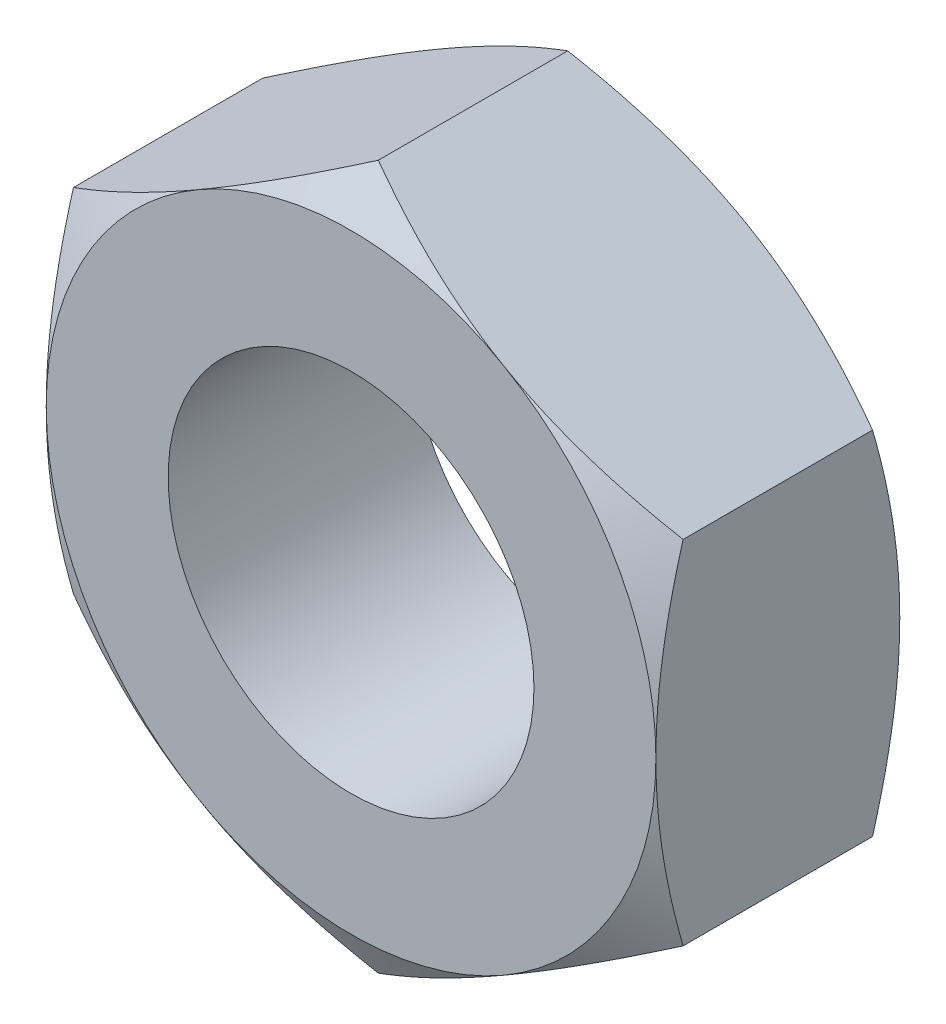
ISO-10303-21;
HEADER;
FILE_DESCRIPTION(('STEP AP214'),'2;1');
FILE_NAME('part.step','',(''),(''),'','','');
FILE_SCHEMA(('AUTOMOTIVE_DESIGN { 1 0 10303 214 1 1 1 1 }'));
ENDSEC;
DATA;
#1=APPLICATION_CONTEXT('core data for automotive mechanical design processes');
#2=APPLICATION_PROTOCOL_DEFINITION('international standard','automotive_design',2000,#1);
#3=PRODUCT_CONTEXT('',#1,'mechanical');
#4=PRODUCT('Part','Part','',(#3));
#5=PRODUCT_RELATED_PRODUCT_CATEGORY('part','',(#4));
#6=PRODUCT_DEFINITION_FORMATION('','',#4);
#7=PRODUCT_DEFINITION_CONTEXT('part definition',#1,'design');
#8=PRODUCT_DEFINITION('design','',#6,#7);
#9=PRODUCT_DEFINITION_SHAPE('','',#8);
#10=(LENGTH_UNIT() NAMED_UNIT(*) SI_UNIT(.MILLI.,.METRE.));
#11=(NAMED_UNIT(*) PLANE_ANGLE_UNIT() SI_UNIT($,.RADIAN.));
#12=(NAMED_UNIT(*) SI_UNIT($,.STERADIAN.) SOLID_ANGLE_UNIT());
#13=UNCERTAINTY_MEASURE_WITH_UNIT(LENGTH_MEASURE(1.E-05),#10,'distance_accuracy_value','');
#14=(GEOMETRIC_REPRESENTATION_CONTEXT(3) GLOBAL_UNCERTAINTY_ASSIGNED_CONTEXT((#13)) GLOBAL_UNIT_ASSIGNED_CONTEXT((#10,
#11,#12)) REPRESENTATION_CONTEXT('',''));
#15=CARTESIAN_POINT('',(0.,0.,0.));
#16=DIRECTION('',(0.,0.,1.));
#17=DIRECTION('',(1.,0.,0.));
#18=AXIS2_PLACEMENT_3D('',#15,#16,#17);
#19=CARTESIAN_POINT('',(-2.49999999999997,-1.44337567297409,2.));
#20=DIRECTION('',(0.499999999999995,0.866025403784441,0.));
#21=DIRECTION('',(-0.866025403784442,0.499999999999995,0.));
#22=AXIS2_PLACEMENT_3D('',#19,#20,#21);
#23=PLANE('',#22);
#24=CARTESIAN_POINT('',(0.000200000000000162,-2.88686681600195,0.2233576643591));
#25=CARTESIAN_POINT('',(-0.109663234734871,-2.82343724785373,0.186721620107618));
#26=CARTESIAN_POINT('',(-0.220474799896525,-2.75946016087833,0.153402218965049));
#27=CARTESIAN_POINT('',(-0.444016833466049,-2.63039810762177,0.0952422855578519));
#28=CARTESIAN_POINT('',(-0.556751274528388,-2.56531084772749,0.0704223291477331));
#29=CARTESIAN_POINT('',(-0.780822993875268,-2.43594298024479,0.0317856514410478));
#30=CARTESIAN_POINT('',(-0.892125791767376,-2.37168227992022,0.0177117961856351));
#31=CARTESIAN_POINT('',(-1.11525522746833,-2.24285844015414,0.000909152352747347));
#32=CARTESIAN_POINT('',(-1.22708105401423,-2.17829576909552,-0.00183354879637574));
#33=CARTESIAN_POINT('',(-1.43604197555152,-2.05765212479586,0.00386576000805192));
#34=CARTESIAN_POINT('',(-1.53320831755773,-2.0015531110824,0.0109083943818601));
#35=CARTESIAN_POINT('',(-1.72690794971099,-1.88972057631678,0.0332314191249406));
#36=CARTESIAN_POINT('',(-1.82344056965972,-1.83398744220381,0.0485194384402649));
#37=CARTESIAN_POINT('',(-2.01753972174046,-1.72192424450051,0.086739093844417));
#38=CARTESIAN_POINT('',(-2.11508168178212,-1.66560836761318,0.109832776125513));
#39=CARTESIAN_POINT('',(-2.30871060807606,-1.55381665489447,0.162246656577907));
#40=CARTESIAN_POINT('',(-2.40480005588615,-1.49833938633504,0.191554535624541));
#41=CARTESIAN_POINT('',(-2.50019999999997,-1.44326020292025,0.2233576643591));
#42=B_SPLINE_CURVE_WITH_KNOTS('',3,(#24,#25,#26,#27,#28,#29,#30,#31,#32,#33,#34,#35,#36,#37,#38,
#39,#40,#41),.UNSPECIFIED.,.F.,.F.,(4,2,2,2,2,2,2,2,4),(0.,0.396285827362224,0.793524330152047,
1.18093086852113,1.56786160134475,1.90479741793731,2.2420455166046,2.58677531536753,
2.93082800105252),.UNSPECIFIED.);
#43=CARTESIAN_POINT('',(0.,-2.88675134594811,0.223290993692593));
#44=VERTEX_POINT('',#43);
#45=CARTESIAN_POINT('',(-1.24999999999999,-2.1650635094611,0.));
#46=VERTEX_POINT('',#45);
#47=EDGE_CURVE('E266',#44,#46,#42,.T.);
#48=ORIENTED_EDGE('',*,*,#47,.F.);
#49=DIRECTION('',(0.,0.,-1.));
#50=VECTOR('',#49,1.);
#51=CARTESIAN_POINT('',(0.,-2.88675134594811,2.));
#52=LINE('',#51,#50);
#53=CARTESIAN_POINT('',(0.,-2.88675134594811,1.77670900630741));
#54=VERTEX_POINT('',#53);
#55=EDGE_CURVE('E309',#54,#44,#52,.T.);
#56=ORIENTED_EDGE('',*,*,#55,.F.);
#57=CARTESIAN_POINT('',(-2.50019999999997,-1.44326020292025,1.7766423356409));
#58=CARTESIAN_POINT('',(-2.3903367652651,-1.50668977106847,1.81327837989238));
#59=CARTESIAN_POINT('',(-2.27952520010345,-1.57066685804387,1.84659778103495));
#60=CARTESIAN_POINT('',(-2.05598316653392,-1.69972891130043,1.90475771444215));
#61=CARTESIAN_POINT('',(-1.94324872547158,-1.76481617119471,1.92957767085227));
#62=CARTESIAN_POINT('',(-1.7191770061247,-1.89418403867742,1.96821434855895));
#63=CARTESIAN_POINT('',(-1.60787420823259,-1.95844473900198,1.98228820381436));
#64=CARTESIAN_POINT('',(-1.38474477253164,-2.08726857876806,1.99909084764725));
#65=CARTESIAN_POINT('',(-1.27291894598575,-2.15183124982668,2.00183354879638));
#66=CARTESIAN_POINT('',(-1.06395802444845,-2.27247489412635,1.99613423999195));
#67=CARTESIAN_POINT('',(-0.966791682442246,-2.3285739078398,1.98909160561814));
#68=CARTESIAN_POINT('',(-0.773092050288979,-2.44040644260542,1.96676858087506));
#69=CARTESIAN_POINT('',(-0.676559430340252,-2.4961395767184,1.95148056155974));
#70=CARTESIAN_POINT('',(-0.482460278259513,-2.60820277442169,1.91326090615558));
#71=CARTESIAN_POINT('',(-0.38491831821785,-2.66451865130902,1.89016722387449));
#72=CARTESIAN_POINT('',(-0.19128939192391,-2.77631036402773,1.83775334342209));
#73=CARTESIAN_POINT('',(-0.0951999441138213,-2.83178763258716,1.80844546437546));
#74=CARTESIAN_POINT('',(0.000200000000000241,-2.88686681600195,1.7766423356409));
#75=B_SPLINE_CURVE_WITH_KNOTS('',3,(#57,#58,#59,#60,#61,#62,#63,#64,#65,#66,#67,#68,#69,#70,#71,
#72,#73,#74),.UNSPECIFIED.,.F.,.F.,(4,2,2,2,2,2,2,2,4),(0.,0.396285827362225,0.793524330152047,
1.18093086852113,1.56786160134475,1.90479741793731,2.2420455166046,2.58677531536753,
2.93082800105252),.UNSPECIFIED.);
#76=CARTESIAN_POINT('',(-1.24999999999999,-2.1650635094611,2.));
#77=VERTEX_POINT('',#76);
#78=EDGE_CURVE('E216',#77,#54,#75,.T.);
#79=ORIENTED_EDGE('',*,*,#78,.F.);
#80=CARTESIAN_POINT('',(-2.49999999999997,-1.44337567297421,1.77670900630749));
#81=VERTEX_POINT('',#80);
#82=EDGE_CURVE('E292',#81,#77,#75,.T.);
#83=ORIENTED_EDGE('',*,*,#82,.F.);
#84=DIRECTION('',(0.,0.,-1.));
#85=VECTOR('',#84,1.);
#86=CARTESIAN_POINT('',(-2.49999999999997,-1.44337567297409,2.));
#87=LINE('',#86,#85);
#88=CARTESIAN_POINT('',(-2.49999999999997,-1.44337567297421,0.223290993692512));
#89=VERTEX_POINT('',#88);
#90=EDGE_CURVE('E289',#81,#89,#87,.T.);
#91=ORIENTED_EDGE('',*,*,#90,.T.);
#92=EDGE_CURVE('E253',#46,#89,#42,.T.);
#93=ORIENTED_EDGE('',*,*,#92,.F.);
#94=EDGE_LOOP('',(#48,#56,#79,#83,#91,#93));
#95=FACE_BOUND('',#94,.T.);
#96=ADVANCED_FACE('F36',(#95),#23,.F.);
#97=CARTESIAN_POINT('',(0.,-2.88675134594811,2.));
#98=DIRECTION('',(-0.500000000000001,0.866025403784438,0.));
#99=DIRECTION('',(-0.866025403784438,-0.500000000000001,0.));
#100=AXIS2_PLACEMENT_3D('',#97,#98,#99);
#101=PLANE('',#100);
#102=CARTESIAN_POINT('',(2.50019999999999,-1.44326020292021,0.2233576643591));
#103=CARTESIAN_POINT('',(2.39033676526512,-1.50668977106843,0.186721620107618));
#104=CARTESIAN_POINT('',(2.27952520010347,-1.57066685804384,0.153402218965048));
#105=CARTESIAN_POINT('',(2.05598316653394,-1.6997289113004,0.0952422855578497));
#106=CARTESIAN_POINT('',(1.94324872547161,-1.76481617119468,0.0704223291477302));
#107=CARTESIAN_POINT('',(1.71917700612473,-1.89418403867739,0.0317856514410439));
#108=CARTESIAN_POINT('',(1.60787420823262,-1.95844473900195,0.0177117961856309));
#109=CARTESIAN_POINT('',(1.38474477253166,-2.08726857876803,0.000909152352742216));
#110=CARTESIAN_POINT('',(1.27291894598577,-2.15183124982665,-0.00183354879638143));
#111=CARTESIAN_POINT('',(1.06395802444848,-2.27247489412632,0.00386576000804523));
#112=CARTESIAN_POINT('',(0.966791682442268,-2.32857390783978,0.0109083943818532));
#113=CARTESIAN_POINT('',(0.773092050288997,-2.4404064426054,0.033231419124934));
#114=CARTESIAN_POINT('',(0.676559430340268,-2.49613957671838,0.0485194384402587));
#115=CARTESIAN_POINT('',(0.482460278259524,-2.60820277442168,0.0867390938444119));
#116=CARTESIAN_POINT('',(0.384918318217859,-2.66451865130902,0.109832776125509));
#117=CARTESIAN_POINT('',(0.191289391923915,-2.77631036402772,0.162246656577905));
#118=CARTESIAN_POINT('',(0.0951999441138241,-2.83178763258716,0.19155453562454));
#119=CARTESIAN_POINT('',(-0.000199999999999883,-2.88686681600195,0.2233576643591));
#120=B_SPLINE_CURVE_WITH_KNOTS('',3,(#102,#103,#104,#105,#106,#107,#108,#109,#110,#111,#112,
#113,#114,#115,#116,#117,#118,#119),.UNSPECIFIED.,.F.,.F.,(4,2,2,2,2,2,2,2,4),(0.,
0.396285827362225,0.793524330152047,1.18093086852113,1.56786160134475,1.90479741793732,
2.24204551660462,2.58677531536755,2.93082800105256),.UNSPECIFIED.);
#121=CARTESIAN_POINT('',(2.49999999999999,-1.44337567297405,0.223290993692593));
#122=VERTEX_POINT('',#121);
#123=CARTESIAN_POINT('',(1.25,-2.1650635094611,0.));
#124=VERTEX_POINT('',#123);
#125=EDGE_CURVE('E144',#122,#124,#120,.T.);
#126=ORIENTED_EDGE('',*,*,#125,.F.);
#127=DIRECTION('',(0.,0.,-1.));
#128=VECTOR('',#127,1.);
#129=CARTESIAN_POINT('',(2.49999999999999,-1.44337567297405,2.));
#130=LINE('',#129,#128);
#131=CARTESIAN_POINT('',(2.49999999999999,-1.44337567297417,1.77670900630749));
#132=VERTEX_POINT('',#131);
#133=EDGE_CURVE('E156',#132,#122,#130,.T.);
#134=ORIENTED_EDGE('',*,*,#133,.F.);
#135=CARTESIAN_POINT('',(-0.000200000000000074,-2.88686681600195,1.7766423356409));
#136=CARTESIAN_POINT('',(0.10966323473487,-2.82343724785373,1.81327837989238));
#137=CARTESIAN_POINT('',(0.220474799896524,-2.75946016087833,1.84659778103495));
#138=CARTESIAN_POINT('',(0.444016833466047,-2.63039810762177,1.90475771444215));
#139=CARTESIAN_POINT('',(0.556751274528385,-2.56531084772748,1.92957767085227));
#140=CARTESIAN_POINT('',(0.780822993875264,-2.43594298024478,1.96821434855896));
#141=CARTESIAN_POINT('',(0.892125791767372,-2.37168227992021,1.98228820381437));
#142=CARTESIAN_POINT('',(1.11525522746833,-2.24285844015414,1.99909084764726));
#143=CARTESIAN_POINT('',(1.22708105401422,-2.17829576909551,2.00183354879638));
#144=CARTESIAN_POINT('',(1.43604197555151,-2.05765212479585,1.99613423999195));
#145=CARTESIAN_POINT('',(1.53320831755772,-2.00155311108239,1.98909160561815));
#146=CARTESIAN_POINT('',(1.72690794971099,-1.88972057631677,1.96676858087507));
#147=CARTESIAN_POINT('',(1.82344056965972,-1.83398744220379,1.95148056155974));
#148=CARTESIAN_POINT('',(2.01753972174047,-1.72192424450049,1.91326090615559));
#149=CARTESIAN_POINT('',(2.11508168178213,-1.66560836761315,1.89016722387449));
#150=CARTESIAN_POINT('',(2.30871060807608,-1.55381665489444,1.8377533434221));
#151=CARTESIAN_POINT('',(2.40480005588617,-1.49833938633501,1.80844546437546));
#152=CARTESIAN_POINT('',(2.50019999999999,-1.44326020292021,1.7766423356409));
#153=B_SPLINE_CURVE_WITH_KNOTS('',3,(#135,#136,#137,#138,#139,#140,#141,#142,#143,#144,#145,
#146,#147,#148,#149,#150,#151,#152),.UNSPECIFIED.,.F.,.F.,(4,2,2,2,2,2,2,2,4),(0.,
0.396285827362224,0.793524330152047,1.18093086852113,1.56786160134475,1.90479741793732,
2.24204551660462,2.58677531536755,2.93082800105256),.UNSPECIFIED.);
#154=CARTESIAN_POINT('',(1.25,-2.16506350946108,2.));
#155=VERTEX_POINT('',#154);
#156=EDGE_CURVE('E199',#155,#132,#153,.T.);
#157=ORIENTED_EDGE('',*,*,#156,.F.);
#158=EDGE_CURVE('E333',#54,#155,#153,.T.);
#159=ORIENTED_EDGE('',*,*,#158,.F.);
#160=ORIENTED_EDGE('',*,*,#55,.T.);
#161=EDGE_CURVE('E166',#124,#44,#120,.T.);
#162=ORIENTED_EDGE('',*,*,#161,.F.);
#163=EDGE_LOOP('',(#126,#134,#157,#159,#160,#162));
#164=FACE_BOUND('',#163,.T.);
#165=ADVANCED_FACE('F179',(#164),#101,.F.);
#166=CARTESIAN_POINT('',(2.49999999999999,-1.44337567297405,2.));
#167=DIRECTION('',(-1.,0.,0.));
#168=DIRECTION('',(0.,-1.,0.));
#169=AXIS2_PLACEMENT_3D('',#166,#167,#168);
#170=PLANE('',#169);
#171=CARTESIAN_POINT('',(2.5,-3.93425573570174,1.24786742231988));
#172=CARTESIAN_POINT('',(2.5,-3.82455805271518,1.19442683286789));
#173=CARTESIAN_POINT('',(2.5,-3.71461458124995,1.1414824250811));
#174=CARTESIAN_POINT('',(2.5,-3.49410553801961,1.03686398179162));
#175=CARTESIAN_POINT('',(2.5,-3.38353987636771,0.985190135952728));
#176=CARTESIAN_POINT('',(2.5,-3.1611133721341,0.883143029913734));
#177=CARTESIAN_POINT('',(2.5,-3.04924878665415,0.832777900698826));
#178=CARTESIAN_POINT('',(2.5,-2.8246495074574,0.734034164431113));
#179=CARTESIAN_POINT('',(2.5,-2.71191485354297,0.685655467138938));
#180=CARTESIAN_POINT('',(2.49999999999999,-2.4815726289783,0.589816347587659));
#181=CARTESIAN_POINT('',(2.49999999999999,-2.36392903093314,0.542442056681136));
#182=CARTESIAN_POINT('',(2.49999999999999,-2.12728680673992,0.451142480581939));
#183=CARTESIAN_POINT('',(2.49999999999999,-2.00828803339158,0.407217574235718));
#184=CARTESIAN_POINT('',(2.49999999999999,-1.76895086303134,0.323927966543298));
#185=CARTESIAN_POINT('',(2.49999999999999,-1.64861554144244,0.284554513885219));
#186=CARTESIAN_POINT('',(2.49999999999999,-1.40621964850133,0.21159319438697));
#187=CARTESIAN_POINT('',(2.49999999999999,-1.28415961496497,0.178003565258964));
#188=CARTESIAN_POINT('',(2.49999999999999,-1.0389195188697,0.118361804718263));
#189=CARTESIAN_POINT('',(2.49999999999999,-0.915749874741587,0.0922676059427502));
#190=CARTESIAN_POINT('',(2.49999999999999,-0.667820858109997,0.0490550373819117));
#191=CARTESIAN_POINT('',(2.49999999999999,-0.543061659325973,0.0319356952253109));
#192=CARTESIAN_POINT('',(2.49999999999999,-0.294229286789481,0.00825976303698975));
#193=CARTESIAN_POINT('',(2.49999999999999,-0.170169796196182,0.0015629187993084));
#194=CARTESIAN_POINT('',(2.49999999999999,0.0780766731615942,-0.00107330125971436));
#195=CARTESIAN_POINT('',(2.49999999999999,0.202263653840971,0.00298748693341116));
#196=CARTESIAN_POINT('',(2.49999999999998,0.411409604725348,0.0185927331632678));
#197=CARTESIAN_POINT('',(2.49999999999998,0.496584671497748,0.0274243081141329));
#198=CARTESIAN_POINT('',(2.49999999999998,0.666344730959548,0.0496284777980075));
#199=CARTESIAN_POINT('',(2.49999999999998,0.750929648415659,0.063001641083345));
#200=CARTESIAN_POINT('',(2.49999999999998,1.00366548007522,0.109234028667318));
#201=CARTESIAN_POINT('',(2.49999999999998,1.17071375552299,0.148199044449048));
#202=CARTESIAN_POINT('',(2.49999999999998,1.4206286514283,0.216203518781425));
#203=CARTESIAN_POINT('',(2.49999999999998,1.50477790209398,0.240801494595756));
#204=CARTESIAN_POINT('',(2.49999999999998,1.67225987920894,0.292660070165323));
#205=CARTESIAN_POINT('',(2.49999999999998,1.75559259937951,0.319920690377339));
#206=CARTESIAN_POINT('',(2.49999999999998,1.92146681890304,0.376658162164918));
#207=CARTESIAN_POINT('',(2.49999999999998,2.00400853495824,0.406134385980853));
#208=CARTESIAN_POINT('',(2.49999999999998,2.16840002368736,0.466945522238705));
#209=CARTESIAN_POINT('',(2.49999999999998,2.25024981200959,0.498280392517164));
#210=CARTESIAN_POINT('',(2.49999999999998,2.47007598379912,0.584843598085943));
#211=CARTESIAN_POINT('',(2.49999999999998,2.60747896260624,0.641526709598319));
#212=CARTESIAN_POINT('',(2.49999999999998,2.88087320813983,0.758212721815775));
#213=CARTESIAN_POINT('',(2.49999999999998,3.01686431759797,0.818215987739867));
#214=CARTESIAN_POINT('',(2.49999999999997,3.28775371033888,0.940755016909798));
#215=CARTESIAN_POINT('',(2.49999999999997,3.42265159883759,1.00329165002619));
#216=CARTESIAN_POINT('',(2.49999999999997,3.69153349617871,1.13030325926438));
#217=CARTESIAN_POINT('',(2.49999999999997,3.82551747693042,1.19477829464024));
#218=CARTESIAN_POINT('',(2.49999999999997,4.22678780318403,1.39065285591914));
#219=CARTESIAN_POINT('',(2.49999999999997,4.49297167508688,1.52430796749618));
#220=CARTESIAN_POINT('',(2.49999999999997,5.02332787108775,1.79538779124832));
#221=CARTESIAN_POINT('',(2.49999999999997,5.28750060208648,1.93281171353398));
#222=CARTESIAN_POINT('',(2.49999999999997,5.78669441053013,2.19560284746361));
#223=CARTESIAN_POINT('',(2.49999999999997,6.02185115865901,2.32071278514315));
#224=CARTESIAN_POINT('',(2.49999999999996,6.49137306636739,2.57244119196158));
#225=CARTESIAN_POINT('',(2.49999999999996,6.7257381764787,2.69905975321281));
#226=CARTESIAN_POINT('',(2.49999999999996,7.19307672107728,2.95299069470952));
#227=CARTESIAN_POINT('',(2.49999999999996,7.42605218847075,3.08029933799));
#228=CARTESIAN_POINT('',(2.49999999999996,7.89150863123006,3.33577450416362));
#229=CARTESIAN_POINT('',(2.49999999999996,8.12398964405185,3.46394095878685));
#230=CARTESIAN_POINT('',(2.49999999999996,8.35629687842252,3.59241944863064));
#231=B_SPLINE_CURVE_WITH_KNOTS('',3,(#171,#172,#173,#174,#175,#176,#177,#178,#179,#180,#181,
#182,#183,#184,#185,#186,#187,#188,#189,#190,#191,#192,#193,#194,#195,#196,#197,#198,#199,#200,
#201,#202,#203,#204,#205,#206,#207,#208,#209,#210,#211,#212,#213,#214,#215,#216,#217,#218,#219,
#220,#221,#222,#223,#224,#225,#226,#227,#228,#229,#230),.UNSPECIFIED.,.F.,.F.,(4,2,2,2,2,2,2,2,
2,2,2,2,2,2,2,2,2,2,2,2,2,2,2,2,2,2,2,2,2,4),(0.,0.366071555956611,0.732197429693603,
1.10022131466406,1.46822846255462,1.84865877257403,2.22913080704688,2.60885867248576,
2.98847063215674,3.36590845840163,3.74330538309199,4.11557841167118,4.4878571160823,
4.74462879425845,5.00143262902233,5.51529120295764,5.7782794978535,6.04126981341614,
6.30418589329148,6.56709601118611,7.01293774320754,7.45882861596655,7.9048739119297,
8.35093285672014,9.24444046413292,10.1377622149405,10.9368546431961,11.7359961144143,
12.5324647674532,13.3288707690047),.UNSPECIFIED.);
#232=CARTESIAN_POINT('',(2.49999999999998,1.44337567297407,0.223290993692593));
#233=VERTEX_POINT('',#232);
#234=CARTESIAN_POINT('',(2.5,0.,0.));
#235=VERTEX_POINT('',#234);
#236=EDGE_CURVE('E125',#233,#235,#231,.F.);
#237=ORIENTED_EDGE('',*,*,#236,.F.);
#238=DIRECTION('',(0.,0.,-1.));
#239=VECTOR('',#238,1.);
#240=CARTESIAN_POINT('',(2.49999999999998,1.44337567297407,2.));
#241=LINE('',#240,#239);
#242=CARTESIAN_POINT('',(2.49999999999998,1.44337567297407,1.77670900630741));
#243=VERTEX_POINT('',#242);
#244=EDGE_CURVE('E307',#243,#233,#241,.T.);
#245=ORIENTED_EDGE('',*,*,#244,.F.);
#246=CARTESIAN_POINT('',(2.5,-3.93425573570174,0.752132577680122));
#247=CARTESIAN_POINT('',(2.5,-3.82455805271518,0.805573167132106));
#248=CARTESIAN_POINT('',(2.5,-3.71461458124995,0.858517574918903));
#249=CARTESIAN_POINT('',(2.5,-3.49410553801961,0.96313601820838));
#250=CARTESIAN_POINT('',(2.5,-3.3835398763677,1.01480986404727));
#251=CARTESIAN_POINT('',(2.5,-3.1611133721341,1.11685697008627));
#252=CARTESIAN_POINT('',(2.5,-3.04924878665415,1.16722209930117));
#253=CARTESIAN_POINT('',(2.5,-2.8246495074574,1.26596583556889));
#254=CARTESIAN_POINT('',(2.5,-2.71191485354297,1.31434453286106));
#255=CARTESIAN_POINT('',(2.49999999999999,-2.4815726289783,1.41018365241234));
#256=CARTESIAN_POINT('',(2.49999999999999,-2.36392903093314,1.45755794331886));
#257=CARTESIAN_POINT('',(2.49999999999999,-2.12728680673992,1.54885751941806));
#258=CARTESIAN_POINT('',(2.49999999999999,-2.00828803339158,1.59278242576428));
#259=CARTESIAN_POINT('',(2.49999999999999,-1.76895086303134,1.6760720334567));
#260=CARTESIAN_POINT('',(2.49999999999999,-1.64861554144244,1.71544548611478));
#261=CARTESIAN_POINT('',(2.49999999999999,-1.40621964850133,1.78840680561303));
#262=CARTESIAN_POINT('',(2.49999999999999,-1.28415961496497,1.82199643474104));
#263=CARTESIAN_POINT('',(2.49999999999999,-1.0389195188697,1.88163819528174));
#264=CARTESIAN_POINT('',(2.49999999999999,-0.915749874741587,1.90773239405725));
#265=CARTESIAN_POINT('',(2.49999999999999,-0.667820858109997,1.95094496261809));
#266=CARTESIAN_POINT('',(2.49999999999999,-0.543061659325972,1.96806430477469));
#267=CARTESIAN_POINT('',(2.49999999999999,-0.294229286789481,1.99174023696301));
#268=CARTESIAN_POINT('',(2.49999999999999,-0.170169796196181,1.99843708120069));
#269=CARTESIAN_POINT('',(2.49999999999999,0.0780766731615949,2.00107330125971));
#270=CARTESIAN_POINT('',(2.49999999999999,0.202263653840971,1.99701251306659));
#271=CARTESIAN_POINT('',(2.49999999999998,0.411409604725348,1.98140726683673));
#272=CARTESIAN_POINT('',(2.49999999999998,0.496584671497748,1.97257569188587));
#273=CARTESIAN_POINT('',(2.49999999999998,0.666344730959547,1.95037152220199));
#274=CARTESIAN_POINT('',(2.49999999999998,0.750929648415658,1.93699835891666));
#275=CARTESIAN_POINT('',(2.49999999999998,1.00366548007522,1.89076597133268));
#276=CARTESIAN_POINT('',(2.49999999999998,1.17071375552299,1.85180095555095));
#277=CARTESIAN_POINT('',(2.49999999999998,1.4206286514283,1.78379648121857));
#278=CARTESIAN_POINT('',(2.49999999999998,1.50477790209398,1.75919850540424));
#279=CARTESIAN_POINT('',(2.49999999999998,1.67225987920894,1.70733992983468));
#280=CARTESIAN_POINT('',(2.49999999999998,1.75559259937951,1.68007930962266));
#281=CARTESIAN_POINT('',(2.49999999999998,1.92146681890304,1.62334183783508));
#282=CARTESIAN_POINT('',(2.49999999999998,2.00400853495824,1.59386561401915));
#283=CARTESIAN_POINT('',(2.49999999999998,2.16840002368736,1.53305447776129));
#284=CARTESIAN_POINT('',(2.49999999999998,2.25024981200959,1.50171960748284));
#285=CARTESIAN_POINT('',(2.49999999999998,2.47007598379913,1.41515640191406));
#286=CARTESIAN_POINT('',(2.49999999999998,2.60747896260624,1.35847329040168));
#287=CARTESIAN_POINT('',(2.49999999999998,2.88087320813983,1.24178727818422));
#288=CARTESIAN_POINT('',(2.49999999999998,3.01686431759797,1.18178401226013));
#289=CARTESIAN_POINT('',(2.49999999999997,3.28775371033888,1.0592449830902));
#290=CARTESIAN_POINT('',(2.49999999999997,3.42265159883759,0.996708349973814));
#291=CARTESIAN_POINT('',(2.49999999999997,3.69153349617871,0.86969674073562));
#292=CARTESIAN_POINT('',(2.49999999999997,3.82551747693042,0.805221705359762));
#293=CARTESIAN_POINT('',(2.49999999999997,4.22678780318403,0.609347144080856));
#294=CARTESIAN_POINT('',(2.49999999999997,4.49297167508688,0.475692032503817));
#295=CARTESIAN_POINT('',(2.49999999999997,5.02332787108775,0.204612208751678));
#296=CARTESIAN_POINT('',(2.49999999999997,5.28750060208648,0.0671882864660215));
#297=CARTESIAN_POINT('',(2.49999999999997,5.78669441053013,-0.195602847463607));
#298=CARTESIAN_POINT('',(2.49999999999997,6.02185115865901,-0.320712785143147));
#299=CARTESIAN_POINT('',(2.49999999999996,6.49137306636739,-0.572441191961576));
#300=CARTESIAN_POINT('',(2.49999999999996,6.7257381764787,-0.699059753212815));
#301=CARTESIAN_POINT('',(2.49999999999996,7.19307672107728,-0.952990694709516));
#302=CARTESIAN_POINT('',(2.49999999999996,7.42605218847075,-1.08029933799));
#303=CARTESIAN_POINT('',(2.49999999999996,7.89150863123006,-1.33577450416362));
#304=CARTESIAN_POINT('',(2.49999999999996,8.12398964405185,-1.46394095878685));
#305=CARTESIAN_POINT('',(2.49999999999996,8.35629687842252,-1.59241944863064));
#306=B_SPLINE_CURVE_WITH_KNOTS('',3,(#246,#247,#248,#249,#250,#251,#252,#253,#254,#255,#256,
#257,#258,#259,#260,#261,#262,#263,#264,#265,#266,#267,#268,#269,#270,#271,#272,#273,#274,#275,
#276,#277,#278,#279,#280,#281,#282,#283,#284,#285,#286,#287,#288,#289,#290,#291,#292,#293,#294,
#295,#296,#297,#298,#299,#300,#301,#302,#303,#304,#305),.UNSPECIFIED.,.F.,.F.,(4,2,2,2,2,2,2,2,
2,2,2,2,2,2,2,2,2,2,2,2,2,2,2,2,2,2,2,2,2,4),(0.,0.366071555956611,0.732197429693603,
1.10022131466407,1.46822846255462,1.84865877257403,2.22913080704688,2.60885867248576,
2.98847063215674,3.36590845840163,3.74330538309199,4.11557841167118,4.4878571160823,
4.74462879425845,5.00143262902233,5.51529120295764,5.7782794978535,6.04126981341614,
6.30418589329148,6.56709601118611,7.01293774320754,7.45882861596655,7.9048739119297,
8.35093285672014,9.24444046413292,10.1377622149405,10.9368546431961,11.7359961144143,
12.5324647674532,13.3288707690047),.UNSPECIFIED.);
#307=CARTESIAN_POINT('',(2.49999999999999,0.,2.));
#308=VERTEX_POINT('',#307);
#309=EDGE_CURVE('E185',#308,#243,#306,.T.);
#310=ORIENTED_EDGE('',*,*,#309,.F.);
#311=EDGE_CURVE('E192',#132,#308,#306,.T.);
#312=ORIENTED_EDGE('',*,*,#311,.F.);
#313=ORIENTED_EDGE('',*,*,#133,.T.);
#314=EDGE_CURVE('E137',#235,#122,#231,.F.);
#315=ORIENTED_EDGE('',*,*,#314,.F.);
#316=EDGE_LOOP('',(#237,#245,#310,#312,#313,#315));
#317=FACE_BOUND('',#316,.T.);
#318=ADVANCED_FACE('F153',(#317),#170,.F.);
#319=CARTESIAN_POINT('',(2.49999999999998,1.44337567297407,2.));
#320=DIRECTION('',(-0.499999999999995,-0.866025403784442,0.));
#321=DIRECTION('',(0.866025403784442,-0.499999999999995,0.));
#322=AXIS2_PLACEMENT_3D('',#319,#320,#321);
#323=PLANE('',#322);
#324=CARTESIAN_POINT('',(-0.000200000000020158,2.88686681600195,0.2233576643591));
#325=CARTESIAN_POINT('',(0.109663234734851,2.82343724785373,0.186721620107617));
#326=CARTESIAN_POINT('',(0.220474799896505,2.75946016087833,0.153402218965048));
#327=CARTESIAN_POINT('',(0.444016833466029,2.63039810762177,0.0952422855578498));
#328=CARTESIAN_POINT('',(0.556751274528367,2.56531084772749,0.0704223291477303));
#329=CARTESIAN_POINT('',(0.780822993875247,2.43594298024479,0.0317856514410441));
#330=CARTESIAN_POINT('',(0.892125791767355,2.37168227992022,0.017711796185631));
#331=CARTESIAN_POINT('',(1.11525522746831,2.24285844015414,0.000909152352742206));
#332=CARTESIAN_POINT('',(1.2270810540142,2.17829576909552,-0.00183354879638151));
#333=CARTESIAN_POINT('',(1.4360419755515,2.05765212479586,0.00386576000804518));
#334=CARTESIAN_POINT('',(1.53320831755771,2.0015531110824,0.0109083943818533));
#335=CARTESIAN_POINT('',(1.72690794971098,1.88972057631678,0.033231419124934));
#336=CARTESIAN_POINT('',(1.82344056965971,1.8339874422038,0.0485194384402585));
#337=CARTESIAN_POINT('',(2.01753972174046,1.7219242445005,0.0867390938444117));
#338=CARTESIAN_POINT('',(2.11508168178212,1.66560836761317,0.109832776125508));
#339=CARTESIAN_POINT('',(2.30871060807607,1.55381665489446,0.162246656577905));
#340=CARTESIAN_POINT('',(2.40480005588616,1.49833938633502,0.19155453562454));
#341=CARTESIAN_POINT('',(2.50019999999998,1.44326020292023,0.2233576643591));
#342=B_SPLINE_CURVE_WITH_KNOTS('',3,(#324,#325,#326,#327,#328,#329,#330,#331,#332,#333,#334,
#335,#336,#337,#338,#339,#340,#341),.UNSPECIFIED.,.F.,.F.,(4,2,2,2,2,2,2,2,4),(0.,
0.396285827362224,0.793524330152047,1.18093086852113,1.56786160134475,1.90479741793732,
2.24204551660462,2.58677531536755,2.93082800105256),.UNSPECIFIED.);
#343=CARTESIAN_POINT('',(0.,2.88675134594811,0.223290993692593));
#344=VERTEX_POINT('',#343);
#345=CARTESIAN_POINT('',(1.24999999999999,2.1650635094611,0.));
#346=VERTEX_POINT('',#345);
#347=EDGE_CURVE('E52',#344,#346,#342,.T.);
#348=ORIENTED_EDGE('',*,*,#347,.F.);
#349=DIRECTION('',(0.,0.,-1.));
#350=VECTOR('',#349,1.);
#351=CARTESIAN_POINT('',(0.,2.88675134594811,2.));
#352=LINE('',#351,#350);
#353=CARTESIAN_POINT('',(0.,2.88675134594811,1.77670900630741));
#354=VERTEX_POINT('',#353);
#355=EDGE_CURVE('E299',#354,#344,#352,.T.);
#356=ORIENTED_EDGE('',*,*,#355,.F.);
#357=CARTESIAN_POINT('',(2.50019999999998,1.44326020292023,1.7766423356409));
#358=CARTESIAN_POINT('',(2.39033676526511,1.50668977106845,1.81327837989238));
#359=CARTESIAN_POINT('',(2.27952520010346,1.57066685804385,1.84659778103495));
#360=CARTESIAN_POINT('',(2.05598316653393,1.69972891130041,1.90475771444215));
#361=CARTESIAN_POINT('',(1.94324872547159,1.7648161711947,1.92957767085227));
#362=CARTESIAN_POINT('',(1.71917700612471,1.8941840386774,1.96821434855896));
#363=CARTESIAN_POINT('',(1.60787420823261,1.95844473900196,1.98228820381437));
#364=CARTESIAN_POINT('',(1.38474477253165,2.08726857876804,1.99909084764726));
#365=CARTESIAN_POINT('',(1.27291894598576,2.15183124982666,2.00183354879638));
#366=CARTESIAN_POINT('',(1.06395802444846,2.27247489412633,1.99613423999195));
#367=CARTESIAN_POINT('',(0.966791682442252,2.32857390783979,1.98909160561815));
#368=CARTESIAN_POINT('',(0.77309205028898,2.44040644260541,1.96676858087507));
#369=CARTESIAN_POINT('',(0.67655943034025,2.49613957671839,1.95148056155974));
#370=CARTESIAN_POINT('',(0.482460278259505,2.60820277442168,1.91326090615559));
#371=CARTESIAN_POINT('',(0.384918318217841,2.66451865130902,1.89016722387449));
#372=CARTESIAN_POINT('',(0.191289391923895,2.77631036402772,1.8377533434221));
#373=CARTESIAN_POINT('',(0.0951999441138043,2.83178763258716,1.80844546437546));
#374=CARTESIAN_POINT('',(-0.000200000000020008,2.88686681600195,1.7766423356409));
#375=B_SPLINE_CURVE_WITH_KNOTS('',3,(#357,#358,#359,#360,#361,#362,#363,#364,#365,#366,#367,
#368,#369,#370,#371,#372,#373,#374),.UNSPECIFIED.,.F.,.F.,(4,2,2,2,2,2,2,2,4),(0.,
0.396285827362225,0.793524330152047,1.18093086852113,1.56786160134475,1.90479741793732,
2.24204551660462,2.58677531536755,2.93082800105256),.UNSPECIFIED.);
#376=CARTESIAN_POINT('',(1.24999999999998,2.16506350946109,2.));
#377=VERTEX_POINT('',#376);
#378=EDGE_CURVE('E194',#377,#354,#375,.T.);
#379=ORIENTED_EDGE('',*,*,#378,.F.);
#380=EDGE_CURVE('E193',#243,#377,#375,.T.);
#381=ORIENTED_EDGE('',*,*,#380,.F.);
#382=ORIENTED_EDGE('',*,*,#244,.T.);
#383=EDGE_CURVE('E131',#346,#233,#342,.T.);
#384=ORIENTED_EDGE('',*,*,#383,.F.);
#385=EDGE_LOOP('',(#348,#356,#379,#381,#382,#384));
#386=FACE_BOUND('',#385,.T.);
#387=ADVANCED_FACE('F178',(#386),#323,.F.);
#388=CARTESIAN_POINT('',(0.,2.88675134594811,2.));
#389=DIRECTION('',(0.500000000000007,-0.866025403784435,0.));
#390=DIRECTION('',(0.866025403784434,0.500000000000007,0.));
#391=AXIS2_PLACEMENT_3D('',#388,#389,#390);
#392=PLANE('',#391);
#393=CARTESIAN_POINT('',(-2.5002,1.4432602029202,0.2233576643591));
#394=CARTESIAN_POINT('',(-2.39033676526513,1.50668977106842,0.186721620107617));
#395=CARTESIAN_POINT('',(-2.27952520010348,1.57066685804382,0.153402218965048));
#396=CARTESIAN_POINT('',(-2.05598316653396,1.69972891130039,0.0952422855578498));
#397=CARTESIAN_POINT('',(-1.94324872547162,1.76481617119467,0.0704223291477304));
#398=CARTESIAN_POINT('',(-1.71917700612474,1.89418403867737,0.0317856514410441));
#399=CARTESIAN_POINT('',(-1.60787420823263,1.95844473900194,0.0177117961856308));
#400=CARTESIAN_POINT('',(-1.38474477253168,2.08726857876802,0.000909152352742026));
#401=CARTESIAN_POINT('',(-1.27291894598579,2.15183124982664,-0.00183354879638151));
#402=CARTESIAN_POINT('',(-1.0639580244485,2.27247489412631,0.00386576000804529));
#403=CARTESIAN_POINT('',(-0.966791682442284,2.32857390783977,0.0109083943818533));
#404=CARTESIAN_POINT('',(-0.773092050289014,2.4404064426054,0.0332314191249341));
#405=CARTESIAN_POINT('',(-0.676559430340285,2.49613957671838,0.0485194384402587));
#406=CARTESIAN_POINT('',(-0.482460278259542,2.60820277442167,0.0867390938444119));
#407=CARTESIAN_POINT('',(-0.384918318217878,2.66451865130901,0.109832776125509));
#408=CARTESIAN_POINT('',(-0.191289391923934,2.77631036402772,0.162246656577905));
#409=CARTESIAN_POINT('',(-0.0951999441138436,2.83178763258716,0.19155453562454));
#410=CARTESIAN_POINT('',(0.000199999999980036,2.88686681600195,0.2233576643591));
#411=B_SPLINE_CURVE_WITH_KNOTS('',3,(#393,#394,#395,#396,#397,#398,#399,#400,#401,#402,#403,
#404,#405,#406,#407,#408,#409,#410),.UNSPECIFIED.,.F.,.F.,(4,2,2,2,2,2,2,2,4),(0.,
0.396285827362225,0.793524330152046,1.18093086852113,1.56786160134475,1.90479741793732,
2.24204551660462,2.58677531536755,2.93082800105256),.UNSPECIFIED.);
#412=CARTESIAN_POINT('',(-2.5,1.44337567297403,0.223290993692593));
#413=VERTEX_POINT('',#412);
#414=CARTESIAN_POINT('',(-1.25000000000002,2.16506350946109,0.));
#415=VERTEX_POINT('',#414);
#416=EDGE_CURVE('E59',#413,#415,#411,.T.);
#417=ORIENTED_EDGE('',*,*,#416,.F.);
#418=DIRECTION('',(0.,0.,-1.));
#419=VECTOR('',#418,1.);
#420=CARTESIAN_POINT('',(-2.5,1.44337567297403,2.));
#421=LINE('',#420,#419);
#422=CARTESIAN_POINT('',(-2.5,1.44337567297403,1.77670900630741));
#423=VERTEX_POINT('',#422);
#424=EDGE_CURVE('E295',#423,#413,#421,.T.);
#425=ORIENTED_EDGE('',*,*,#424,.F.);
#426=CARTESIAN_POINT('',(0.000199999999979915,2.88686681600195,1.7766423356409));
#427=CARTESIAN_POINT('',(-0.10966323473489,2.82343724785373,1.81327837989238));
#428=CARTESIAN_POINT('',(-0.220474799896544,2.75946016087833,1.84659778103495));
#429=CARTESIAN_POINT('',(-0.444016833466065,2.63039810762176,1.90475771444215));
#430=CARTESIAN_POINT('',(-0.556751274528403,2.56531084772748,1.92957767085227));
#431=CARTESIAN_POINT('',(-0.780822993875281,2.43594298024477,1.96821434855896));
#432=CARTESIAN_POINT('',(-0.892125791767388,2.37168227992021,1.98228820381437));
#433=CARTESIAN_POINT('',(-1.11525522746834,2.24285844015413,1.99909084764726));
#434=CARTESIAN_POINT('',(-1.22708105401423,2.17829576909551,2.00183354879638));
#435=CARTESIAN_POINT('',(-1.43604197555153,2.05765212479584,1.99613423999195));
#436=CARTESIAN_POINT('',(-1.53320831755774,2.00155311108238,1.98909160561815));
#437=CARTESIAN_POINT('',(-1.72690794971101,1.88972057631675,1.96676858087507));
#438=CARTESIAN_POINT('',(-1.82344056965974,1.83398744220377,1.95148056155974));
#439=CARTESIAN_POINT('',(-2.01753972174048,1.72192424450048,1.91326090615559));
#440=CARTESIAN_POINT('',(-2.11508168178214,1.66560836761314,1.89016722387449));
#441=CARTESIAN_POINT('',(-2.30871060807609,1.55381665489443,1.8377533434221));
#442=CARTESIAN_POINT('',(-2.40480005588618,1.49833938633499,1.80844546437546));
#443=CARTESIAN_POINT('',(-2.5002,1.4432602029202,1.7766423356409));
#444=B_SPLINE_CURVE_WITH_KNOTS('',3,(#426,#427,#428,#429,#430,#431,#432,#433,#434,#435,#436,
#437,#438,#439,#440,#441,#442,#443),.UNSPECIFIED.,.F.,.F.,(4,2,2,2,2,2,2,2,4),(0.,
0.396285827362225,0.793524330152047,1.18093086852113,1.56786160134475,1.90479741793732,
2.24204551660462,2.58677531536755,2.93082800105256),.UNSPECIFIED.);
#445=CARTESIAN_POINT('',(-1.25000000000001,2.16506350946107,2.));
#446=VERTEX_POINT('',#445);
#447=EDGE_CURVE('E232',#446,#423,#444,.T.);
#448=ORIENTED_EDGE('',*,*,#447,.F.);
#449=EDGE_CURVE('E237',#354,#446,#444,.T.);
#450=ORIENTED_EDGE('',*,*,#449,.F.);
#451=ORIENTED_EDGE('',*,*,#355,.T.);
#452=EDGE_CURVE('E255',#415,#344,#411,.T.);
#453=ORIENTED_EDGE('',*,*,#452,.F.);
#454=EDGE_LOOP('',(#417,#425,#448,#450,#451,#453));
#455=FACE_BOUND('',#454,.T.);
#456=ADVANCED_FACE('F238',(#455),#392,.F.);
#457=CARTESIAN_POINT('',(-2.5,1.44337567297403,2.));
#458=DIRECTION('',(1.,0.,0.));
#459=DIRECTION('',(0.,1.,0.));
#460=AXIS2_PLACEMENT_3D('',#457,#458,#459);
#461=PLANE('',#460);
#462=CARTESIAN_POINT('',(-2.49999999999995,-3.93425573570178,1.24786742231988));
#463=CARTESIAN_POINT('',(-2.49999999999995,-3.82455805271521,1.19442683286789));
#464=CARTESIAN_POINT('',(-2.49999999999995,-3.71461458124999,1.1414824250811));
#465=CARTESIAN_POINT('',(-2.49999999999995,-3.49410553801965,1.03686398179162));
#466=CARTESIAN_POINT('',(-2.49999999999995,-3.38353987636774,0.985190135952728));
#467=CARTESIAN_POINT('',(-2.49999999999995,-3.16111337213413,0.883143029913734));
#468=CARTESIAN_POINT('',(-2.49999999999995,-3.04924878665418,0.832777900698826));
#469=CARTESIAN_POINT('',(-2.49999999999996,-2.82464950745744,0.734034164431113));
#470=CARTESIAN_POINT('',(-2.49999999999996,-2.711914853543,0.685655467138938));
#471=CARTESIAN_POINT('',(-2.49999999999996,-2.48157262897833,0.589816347587658));
#472=CARTESIAN_POINT('',(-2.49999999999996,-2.36392903093318,0.542442056681136));
#473=CARTESIAN_POINT('',(-2.49999999999996,-2.12728680673995,0.451142480581939));
#474=CARTESIAN_POINT('',(-2.49999999999997,-2.00828803339161,0.407217574235718));
#475=CARTESIAN_POINT('',(-2.49999999999997,-1.76895086303137,0.323927966543298));
#476=CARTESIAN_POINT('',(-2.49999999999997,-1.64861554144248,0.284554513885218));
#477=CARTESIAN_POINT('',(-2.49999999999997,-1.40621964850137,0.21159319438697));
#478=CARTESIAN_POINT('',(-2.49999999999997,-1.28415961496501,0.178003565258964));
#479=CARTESIAN_POINT('',(-2.49999999999998,-1.03891951886973,0.118361804718263));
#480=CARTESIAN_POINT('',(-2.49999999999998,-0.915749874741622,0.0922676059427501));
#481=CARTESIAN_POINT('',(-2.49999999999998,-0.667820858110031,0.0490550373819117));
#482=CARTESIAN_POINT('',(-2.49999999999998,-0.543061659326007,0.0319356952253111));
#483=CARTESIAN_POINT('',(-2.49999999999998,-0.294229286789515,0.00825976303698988));
#484=CARTESIAN_POINT('',(-2.49999999999998,-0.170169796196216,0.00156291879930829));
#485=CARTESIAN_POINT('',(-2.49999999999999,0.0780766731615602,-0.00107330125971448));
#486=CARTESIAN_POINT('',(-2.49999999999999,0.202263653840937,0.0029874869334112));
#487=CARTESIAN_POINT('',(-2.49999999999999,0.411409604725314,0.018592733163268));
#488=CARTESIAN_POINT('',(-2.49999999999999,0.496584671497714,0.0274243081141331));
#489=CARTESIAN_POINT('',(-2.49999999999999,0.666344730959513,0.0496284777980076));
#490=CARTESIAN_POINT('',(-2.49999999999999,0.750929648415624,0.0630016410833449));
#491=CARTESIAN_POINT('',(-2.5,1.00366548007519,0.109234028667318));
#492=CARTESIAN_POINT('',(-2.5,1.17071375552296,0.148199044449049));
#493=CARTESIAN_POINT('',(-2.5,1.42062865142827,0.216203518781425));
#494=CARTESIAN_POINT('',(-2.5,1.50477790209394,0.240801494595756));
#495=CARTESIAN_POINT('',(-2.5,1.67225987920891,0.292660070165323));
#496=CARTESIAN_POINT('',(-2.5,1.75559259937948,0.319920690377339));
#497=CARTESIAN_POINT('',(-2.50000000000001,1.921466818903,0.376658162164918));
#498=CARTESIAN_POINT('',(-2.50000000000001,2.00400853495821,0.406134385980853));
#499=CARTESIAN_POINT('',(-2.50000000000001,2.16840002368732,0.466945522238705));
#500=CARTESIAN_POINT('',(-2.50000000000001,2.25024981200956,0.498280392517164));
#501=CARTESIAN_POINT('',(-2.50000000000001,2.47007598379909,0.584843598085943));
#502=CARTESIAN_POINT('',(-2.50000000000001,2.6074789626062,0.641526709598319));
#503=CARTESIAN_POINT('',(-2.50000000000002,2.8808732081398,0.758212721815775));
#504=CARTESIAN_POINT('',(-2.50000000000002,3.01686431759794,0.818215987739867));
#505=CARTESIAN_POINT('',(-2.50000000000002,3.28775371033885,0.940755016909798));
#506=CARTESIAN_POINT('',(-2.50000000000002,3.42265159883755,1.00329165002619));
#507=CARTESIAN_POINT('',(-2.50000000000002,3.69153349617867,1.13030325926438));
#508=CARTESIAN_POINT('',(-2.50000000000003,3.82551747693038,1.19477829464024));
#509=CARTESIAN_POINT('',(-2.50000000000003,4.226787803184,1.39065285591914));
#510=CARTESIAN_POINT('',(-2.50000000000003,4.49297167508684,1.52430796749618));
#511=CARTESIAN_POINT('',(-2.50000000000004,5.02332787108771,1.79538779124832));
#512=CARTESIAN_POINT('',(-2.50000000000004,5.28750060208644,1.93281171353398));
#513=CARTESIAN_POINT('',(-2.50000000000005,5.78669441053009,2.19560284746361));
#514=CARTESIAN_POINT('',(-2.50000000000005,6.02185115865897,2.32071278514315));
#515=CARTESIAN_POINT('',(-2.50000000000005,6.49137306636735,2.57244119196158));
#516=CARTESIAN_POINT('',(-2.50000000000006,6.72573817647867,2.69905975321281));
#517=CARTESIAN_POINT('',(-2.50000000000006,7.19307672107724,2.95299069470952));
#518=CARTESIAN_POINT('',(-2.50000000000006,7.42605218847072,3.08029933799));
#519=CARTESIAN_POINT('',(-2.50000000000007,7.89150863123003,3.33577450416362));
#520=CARTESIAN_POINT('',(-2.50000000000007,8.12398964405182,3.46394095878685));
#521=CARTESIAN_POINT('',(-2.50000000000007,8.35629687842248,3.59241944863064));
#522=B_SPLINE_CURVE_WITH_KNOTS('',3,(#462,#463,#464,#465,#466,#467,#468,#469,#470,#471,#472,
#473,#474,#475,#476,#477,#478,#479,#480,#481,#482,#483,#484,#485,#486,#487,#488,#489,#490,#491,
#492,#493,#494,#495,#496,#497,#498,#499,#500,#501,#502,#503,#504,#505,#506,#507,#508,#509,#510,
#511,#512,#513,#514,#515,#516,#517,#518,#519,#520,#521),.UNSPECIFIED.,.F.,.F.,(4,2,2,2,2,2,2,2,
2,2,2,2,2,2,2,2,2,2,2,2,2,2,2,2,2,2,2,2,2,4),(0.,0.36607155595661,0.732197429693602,
1.10022131466406,1.46822846255462,1.84865877257403,2.22913080704688,2.60885867248576,
2.98847063215673,3.36590845840163,3.74330538309199,4.11557841167118,4.4878571160823,
4.74462879425845,5.00143262902233,5.51529120295763,5.7782794978535,6.04126981341614,
6.30418589329148,6.5670960111861,7.01293774320754,7.45882861596654,7.9048739119297,
8.35093285672014,9.24444046413291,10.1377622149405,10.936854643196,11.7359961144143,
12.5324647674532,13.3288707690047),.UNSPECIFIED.);
#523=CARTESIAN_POINT('',(-2.49999999999999,0.,0.));
#524=VERTEX_POINT('',#523);
#525=EDGE_CURVE('E254',#89,#524,#522,.T.);
#526=ORIENTED_EDGE('',*,*,#525,.F.);
#527=ORIENTED_EDGE('',*,*,#90,.F.);
#528=CARTESIAN_POINT('',(-2.49999999999995,-3.93425573570178,0.752132577680122));
#529=CARTESIAN_POINT('',(-2.49999999999995,-3.82455805271521,0.805573167132106));
#530=CARTESIAN_POINT('',(-2.49999999999995,-3.71461458124999,0.858517574918904));
#531=CARTESIAN_POINT('',(-2.49999999999995,-3.49410553801964,0.963136018208381));
#532=CARTESIAN_POINT('',(-2.49999999999995,-3.38353987636774,1.01480986404727));
#533=CARTESIAN_POINT('',(-2.49999999999995,-3.16111337213413,1.11685697008627));
#534=CARTESIAN_POINT('',(-2.49999999999995,-3.04924878665418,1.16722209930117));
#535=CARTESIAN_POINT('',(-2.49999999999996,-2.82464950745744,1.26596583556889));
#536=CARTESIAN_POINT('',(-2.49999999999996,-2.711914853543,1.31434453286106));
#537=CARTESIAN_POINT('',(-2.49999999999996,-2.48157262897833,1.41018365241234));
#538=CARTESIAN_POINT('',(-2.49999999999996,-2.36392903093317,1.45755794331887));
#539=CARTESIAN_POINT('',(-2.49999999999996,-2.12728680673995,1.54885751941806));
#540=CARTESIAN_POINT('',(-2.49999999999997,-2.00828803339161,1.59278242576428));
#541=CARTESIAN_POINT('',(-2.49999999999997,-1.76895086303137,1.6760720334567));
#542=CARTESIAN_POINT('',(-2.49999999999997,-1.64861554144248,1.71544548611478));
#543=CARTESIAN_POINT('',(-2.49999999999997,-1.40621964850137,1.78840680561303));
#544=CARTESIAN_POINT('',(-2.49999999999997,-1.28415961496501,1.82199643474104));
#545=CARTESIAN_POINT('',(-2.49999999999998,-1.03891951886973,1.88163819528174));
#546=CARTESIAN_POINT('',(-2.49999999999998,-0.915749874741622,1.90773239405725));
#547=CARTESIAN_POINT('',(-2.49999999999998,-0.667820858110031,1.95094496261809));
#548=CARTESIAN_POINT('',(-2.49999999999998,-0.543061659326007,1.96806430477469));
#549=CARTESIAN_POINT('',(-2.49999999999998,-0.294229286789515,1.99174023696301));
#550=CARTESIAN_POINT('',(-2.49999999999998,-0.170169796196215,1.99843708120069));
#551=CARTESIAN_POINT('',(-2.49999999999999,0.0780766731615604,2.00107330125971));
#552=CARTESIAN_POINT('',(-2.49999999999999,0.202263653840937,1.99701251306659));
#553=CARTESIAN_POINT('',(-2.49999999999999,0.411409604725314,1.98140726683673));
#554=CARTESIAN_POINT('',(-2.49999999999999,0.496584671497714,1.97257569188587));
#555=CARTESIAN_POINT('',(-2.49999999999999,0.666344730959513,1.95037152220199));
#556=CARTESIAN_POINT('',(-2.49999999999999,0.750929648415624,1.93699835891666));
#557=CARTESIAN_POINT('',(-2.5,1.00366548007519,1.89076597133268));
#558=CARTESIAN_POINT('',(-2.5,1.17071375552296,1.85180095555095));
#559=CARTESIAN_POINT('',(-2.5,1.42062865142827,1.78379648121857));
#560=CARTESIAN_POINT('',(-2.5,1.50477790209394,1.75919850540424));
#561=CARTESIAN_POINT('',(-2.5,1.67225987920891,1.70733992983468));
#562=CARTESIAN_POINT('',(-2.5,1.75559259937948,1.68007930962266));
#563=CARTESIAN_POINT('',(-2.50000000000001,1.921466818903,1.62334183783508));
#564=CARTESIAN_POINT('',(-2.50000000000001,2.00400853495821,1.59386561401915));
#565=CARTESIAN_POINT('',(-2.50000000000001,2.16840002368732,1.53305447776129));
#566=CARTESIAN_POINT('',(-2.50000000000001,2.25024981200956,1.50171960748284));
#567=CARTESIAN_POINT('',(-2.50000000000001,2.47007598379909,1.41515640191406));
#568=CARTESIAN_POINT('',(-2.50000000000001,2.6074789626062,1.35847329040168));
#569=CARTESIAN_POINT('',(-2.50000000000002,2.88087320813979,1.24178727818422));
#570=CARTESIAN_POINT('',(-2.50000000000002,3.01686431759793,1.18178401226013));
#571=CARTESIAN_POINT('',(-2.50000000000002,3.28775371033885,1.0592449830902));
#572=CARTESIAN_POINT('',(-2.50000000000002,3.42265159883755,0.996708349973815));
#573=CARTESIAN_POINT('',(-2.50000000000002,3.69153349617867,0.86969674073562));
#574=CARTESIAN_POINT('',(-2.50000000000003,3.82551747693038,0.805221705359763));
#575=CARTESIAN_POINT('',(-2.50000000000003,4.226787803184,0.609347144080856));
#576=CARTESIAN_POINT('',(-2.50000000000003,4.49297167508684,0.475692032503817));
#577=CARTESIAN_POINT('',(-2.50000000000004,5.02332787108771,0.204612208751677));
#578=CARTESIAN_POINT('',(-2.50000000000004,5.28750060208644,0.0671882864660208));
#579=CARTESIAN_POINT('',(-2.50000000000005,5.7866944105301,-0.195602847463608));
#580=CARTESIAN_POINT('',(-2.50000000000005,6.02185115865897,-0.320712785143147));
#581=CARTESIAN_POINT('',(-2.50000000000005,6.49137306636735,-0.572441191961576));
#582=CARTESIAN_POINT('',(-2.50000000000006,6.72573817647867,-0.699059753212814));
#583=CARTESIAN_POINT('',(-2.50000000000006,7.19307672107724,-0.952990694709516));
#584=CARTESIAN_POINT('',(-2.50000000000006,7.42605218847072,-1.08029933799));
#585=CARTESIAN_POINT('',(-2.50000000000007,7.89150863123003,-1.33577450416362));
#586=CARTESIAN_POINT('',(-2.50000000000007,8.12398964405181,-1.46394095878685));
#587=CARTESIAN_POINT('',(-2.50000000000007,8.35629687842248,-1.59241944863064));
#588=B_SPLINE_CURVE_WITH_KNOTS('',3,(#528,#529,#530,#531,#532,#533,#534,#535,#536,#537,#538,
#539,#540,#541,#542,#543,#544,#545,#546,#547,#548,#549,#550,#551,#552,#553,#554,#555,#556,#557,
#558,#559,#560,#561,#562,#563,#564,#565,#566,#567,#568,#569,#570,#571,#572,#573,#574,#575,#576,
#577,#578,#579,#580,#581,#582,#583,#584,#585,#586,#587),.UNSPECIFIED.,.F.,.F.,(4,2,2,2,2,2,2,2,
2,2,2,2,2,2,2,2,2,2,2,2,2,2,2,2,2,2,2,2,2,4),(0.,0.366071555956611,0.732197429693604,
1.10022131466406,1.46822846255462,1.84865877257403,2.22913080704688,2.60885867248576,
2.98847063215673,3.36590845840163,3.74330538309199,4.11557841167118,4.4878571160823,
4.74462879425845,5.00143262902233,5.51529120295763,5.7782794978535,6.04126981341614,
6.30418589329148,6.56709601118611,7.01293774320754,7.45882861596654,7.9048739119297,
8.35093285672014,9.24444046413292,10.1377622149405,10.9368546431961,11.7359961144143,
12.5324647674532,13.3288707690047),.UNSPECIFIED.);
#589=CARTESIAN_POINT('',(-2.49999999999999,0.,2.));
#590=VERTEX_POINT('',#589);
#591=EDGE_CURVE('E224',#590,#81,#588,.F.);
#592=ORIENTED_EDGE('',*,*,#591,.F.);
#593=EDGE_CURVE('E149',#423,#590,#588,.F.);
#594=ORIENTED_EDGE('',*,*,#593,.F.);
#595=ORIENTED_EDGE('',*,*,#424,.T.);
#596=EDGE_CURVE('E256',#524,#413,#522,.T.);
#597=ORIENTED_EDGE('',*,*,#596,.F.);
#598=EDGE_LOOP('',(#526,#527,#592,#594,#595,#597));
#599=FACE_BOUND('',#598,.T.);
#600=ADVANCED_FACE('F241',(#599),#461,.F.);
#601=CARTESIAN_POINT('',(0.,0.,0.));
#602=DIRECTION('',(0.,0.,1.));
#603=DIRECTION('',(1.,0.,0.));
#604=AXIS2_PLACEMENT_3D('',#601,#602,#603);
#605=PLANE('',#604);
#606=CARTESIAN_POINT('',(0.,0.,0.));
#607=DIRECTION('',(0.,0.,1.));
#608=DIRECTION('',(1.,0.,0.));
#609=AXIS2_PLACEMENT_3D('',#606,#607,#608);
#610=CIRCLE('',#609,1.5);
#611=CARTESIAN_POINT('',(1.5,0.,0.));
#612=VERTEX_POINT('',#611);
#613=EDGE_CURVE('E302',#612,#612,#610,.T.);
#614=ORIENTED_EDGE('',*,*,#613,.T.);
#615=EDGE_LOOP('',(#614));
#616=FACE_BOUND('',#615,.T.);
#617=CARTESIAN_POINT('',(0.,0.,0.));
#618=DIRECTION('',(0.,0.,1.));
#619=DIRECTION('',(1.,0.,0.));
#620=AXIS2_PLACEMENT_3D('',#617,#618,#619);
#621=CIRCLE('',#620,2.5);
#622=EDGE_CURVE('E12',#235,#346,#621,.T.);
#623=ORIENTED_EDGE('',*,*,#622,.F.);
#624=EDGE_CURVE('E40',#124,#235,#621,.T.);
#625=ORIENTED_EDGE('',*,*,#624,.F.);
#626=EDGE_CURVE('E148',#46,#124,#621,.T.);
#627=ORIENTED_EDGE('',*,*,#626,.F.);
#628=EDGE_CURVE('E282',#524,#46,#621,.T.);
#629=ORIENTED_EDGE('',*,*,#628,.F.);
#630=CARTESIAN_POINT('',(0.,0.,0.));
#631=DIRECTION('',(0.,0.,-1.));
#632=DIRECTION('',(-1.,0.,0.));
#633=AXIS2_PLACEMENT_3D('',#630,#631,#632);
#634=CIRCLE('',#633,2.5);
#635=EDGE_CURVE('E348',#524,#415,#634,.T.);
#636=ORIENTED_EDGE('',*,*,#635,.T.);
#637=EDGE_CURVE('E45',#346,#415,#621,.T.);
#638=ORIENTED_EDGE('',*,*,#637,.F.);
#639=EDGE_LOOP('',(#623,#625,#627,#629,#636,#638));
#640=FACE_BOUND('',#639,.T.);
#641=ADVANCED_FACE('F150',(#616,#640),#605,.F.);
#642=CARTESIAN_POINT('',(0.,0.,2.));
#643=DIRECTION('',(0.,0.,1.));
#644=DIRECTION('',(1.,0.,0.));
#645=AXIS2_PLACEMENT_3D('',#642,#643,#644);
#646=PLANE('',#645);
#647=CARTESIAN_POINT('',(0.,0.,2.));
#648=DIRECTION('',(0.,0.,1.));
#649=DIRECTION('',(1.,0.,0.));
#650=AXIS2_PLACEMENT_3D('',#647,#648,#649);
#651=CIRCLE('',#650,1.5);
#652=CARTESIAN_POINT('',(1.5,0.,2.));
#653=VERTEX_POINT('',#652);
#654=EDGE_CURVE('E296',#653,#653,#651,.T.);
#655=ORIENTED_EDGE('',*,*,#654,.F.);
#656=EDGE_LOOP('',(#655));
#657=FACE_BOUND('',#656,.T.);
#658=CARTESIAN_POINT('',(0.,0.,2.));
#659=DIRECTION('',(0.,0.,1.));
#660=DIRECTION('',(1.,0.,0.));
#661=AXIS2_PLACEMENT_3D('',#658,#659,#660);
#662=CIRCLE('',#661,2.5);
#663=EDGE_CURVE('E136',#155,#308,#662,.T.);
#664=ORIENTED_EDGE('',*,*,#663,.T.);
#665=EDGE_CURVE('E171',#308,#377,#662,.T.);
#666=ORIENTED_EDGE('',*,*,#665,.T.);
#667=EDGE_CURVE('E329',#377,#446,#662,.T.);
#668=ORIENTED_EDGE('',*,*,#667,.T.);
#669=EDGE_CURVE('E316',#446,#590,#662,.T.);
#670=ORIENTED_EDGE('',*,*,#669,.T.);
#671=EDGE_CURVE('E321',#590,#77,#662,.T.);
#672=ORIENTED_EDGE('',*,*,#671,.T.);
#673=EDGE_CURVE('E324',#77,#155,#662,.T.);
#674=ORIENTED_EDGE('',*,*,#673,.T.);
#675=EDGE_LOOP('',(#664,#666,#668,#670,#672,#674));
#676=FACE_BOUND('',#675,.T.);
#677=ADVANCED_FACE('F327',(#657,#676),#646,.T.);
#678=CARTESIAN_POINT('',(0.,0.,2.));
#679=DIRECTION('',(0.,0.,-1.));
#680=DIRECTION('',(-1.,0.,0.));
#681=AXIS2_PLACEMENT_3D('',#678,#679,#680);
#682=CYLINDRICAL_SURFACE('',#681,1.5);
#683=ORIENTED_EDGE('',*,*,#654,.T.);
#684=EDGE_LOOP('',(#683));
#685=FACE_BOUND('',#684,.T.);
#686=ORIENTED_EDGE('',*,*,#613,.F.);
#687=EDGE_LOOP('',(#686));
#688=FACE_BOUND('',#687,.T.);
#689=ADVANCED_FACE('F210',(#685,#688),#682,.F.);
#690=CARTESIAN_POINT('',(0.,0.,2.));
#691=DIRECTION('',(0.,0.,-1.));
#692=DIRECTION('',(1.,0.,0.));
#693=AXIS2_PLACEMENT_3D('',#690,#691,#692);
#694=CONICAL_SURFACE('',#693,2.5,1.0471975511966);
#695=ORIENTED_EDGE('',*,*,#82,.T.);
#696=ORIENTED_EDGE('',*,*,#671,.F.);
#697=ORIENTED_EDGE('',*,*,#591,.T.);
#698=EDGE_LOOP('',(#695,#696,#697));
#699=FACE_BOUND('',#698,.T.);
#700=ADVANCED_FACE('F205',(#699),#694,.T.);
#701=ORIENTED_EDGE('',*,*,#447,.T.);
#702=ORIENTED_EDGE('',*,*,#593,.T.);
#703=ORIENTED_EDGE('',*,*,#669,.F.);
#704=EDGE_LOOP('',(#701,#702,#703));
#705=FACE_BOUND('',#704,.T.);
#706=ADVANCED_FACE('F209',(#705),#694,.T.);
#707=ORIENTED_EDGE('',*,*,#378,.T.);
#708=ORIENTED_EDGE('',*,*,#449,.T.);
#709=ORIENTED_EDGE('',*,*,#667,.F.);
#710=EDGE_LOOP('',(#707,#708,#709));
#711=FACE_BOUND('',#710,.T.);
#712=ADVANCED_FACE('F347',(#711),#694,.T.);
#713=ORIENTED_EDGE('',*,*,#309,.T.);
#714=ORIENTED_EDGE('',*,*,#380,.T.);
#715=ORIENTED_EDGE('',*,*,#665,.F.);
#716=EDGE_LOOP('',(#713,#714,#715));
#717=FACE_BOUND('',#716,.T.);
#718=ADVANCED_FACE('F340',(#717),#694,.T.);
#719=ORIENTED_EDGE('',*,*,#156,.T.);
#720=ORIENTED_EDGE('',*,*,#311,.T.);
#721=ORIENTED_EDGE('',*,*,#663,.F.);
#722=EDGE_LOOP('',(#719,#720,#721));
#723=FACE_BOUND('',#722,.T.);
#724=ADVANCED_FACE('F337',(#723),#694,.T.);
#725=ORIENTED_EDGE('',*,*,#78,.T.);
#726=ORIENTED_EDGE('',*,*,#158,.T.);
#727=ORIENTED_EDGE('',*,*,#673,.F.);
#728=EDGE_LOOP('',(#725,#726,#727));
#729=FACE_BOUND('',#728,.T.);
#730=ADVANCED_FACE('F212',(#729),#694,.T.);
#731=CARTESIAN_POINT('',(0.,0.,0.));
#732=DIRECTION('',(0.,0.,1.));
#733=DIRECTION('',(-1.,0.,0.));
#734=AXIS2_PLACEMENT_3D('',#731,#732,#733);
#735=CONICAL_SURFACE('',#734,2.5,1.0471975511966);
#736=ORIENTED_EDGE('',*,*,#314,.T.);
#737=ORIENTED_EDGE('',*,*,#125,.T.);
#738=ORIENTED_EDGE('',*,*,#624,.T.);
#739=EDGE_LOOP('',(#736,#737,#738));
#740=FACE_BOUND('',#739,.T.);
#741=ADVANCED_FACE('F142',(#740),#735,.T.);
#742=ORIENTED_EDGE('',*,*,#161,.T.);
#743=ORIENTED_EDGE('',*,*,#47,.T.);
#744=ORIENTED_EDGE('',*,*,#626,.T.);
#745=EDGE_LOOP('',(#742,#743,#744));
#746=FACE_BOUND('',#745,.T.);
#747=ADVANCED_FACE('F275',(#746),#735,.T.);
#748=ORIENTED_EDGE('',*,*,#92,.T.);
#749=ORIENTED_EDGE('',*,*,#525,.T.);
#750=ORIENTED_EDGE('',*,*,#628,.T.);
#751=EDGE_LOOP('',(#748,#749,#750));
#752=FACE_BOUND('',#751,.T.);
#753=ADVANCED_FACE('F283',(#752),#735,.T.);
#754=ORIENTED_EDGE('',*,*,#416,.T.);
#755=ORIENTED_EDGE('',*,*,#635,.F.);
#756=ORIENTED_EDGE('',*,*,#596,.T.);
#757=EDGE_LOOP('',(#754,#755,#756));
#758=FACE_BOUND('',#757,.T.);
#759=ADVANCED_FACE('F349',(#758),#735,.T.);
#760=ORIENTED_EDGE('',*,*,#347,.T.);
#761=ORIENTED_EDGE('',*,*,#637,.T.);
#762=ORIENTED_EDGE('',*,*,#452,.T.);
#763=EDGE_LOOP('',(#760,#761,#762));
#764=FACE_BOUND('',#763,.T.);
#765=ADVANCED_FACE('F351',(#764),#735,.T.);
#766=ORIENTED_EDGE('',*,*,#236,.T.);
#767=ORIENTED_EDGE('',*,*,#622,.T.);
#768=ORIENTED_EDGE('',*,*,#383,.T.);
#769=EDGE_LOOP('',(#766,#767,#768));
#770=FACE_BOUND('',#769,.T.);
#771=ADVANCED_FACE('F127',(#770),#735,.T.);
#772=CLOSED_SHELL('',(#96,#165,#318,#387,#456,#600,#641,#677,#689,#700,#706,#712,#718,#724,#730,
#741,#747,#753,#759,#765,#771));
#773=MANIFOLD_SOLID_BREP('B2',#772);
#774=ADVANCED_BREP_SHAPE_REPRESENTATION('',(#18,#773),#14);
#775=SHAPE_DEFINITION_REPRESENTATION(#9,#774);
ENDSEC;
END-ISO-10303-21;
